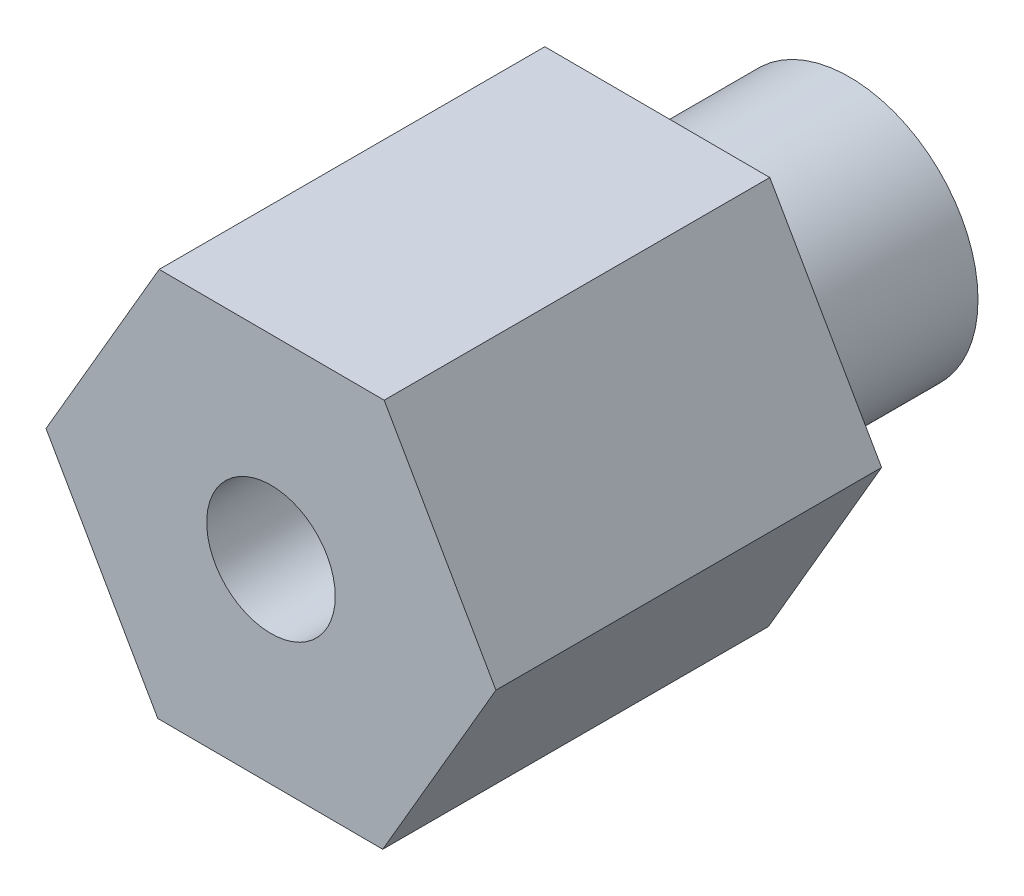
ISO-10303-21;
HEADER;
FILE_DESCRIPTION(('STEP AP214'),'2;1');
FILE_NAME('part.step','',(''),(''),'','','');
FILE_SCHEMA(('AUTOMOTIVE_DESIGN { 1 0 10303 214 1 1 1 1 }'));
ENDSEC;
DATA;
#1=APPLICATION_CONTEXT('core data for automotive mechanical design processes');
#2=APPLICATION_PROTOCOL_DEFINITION('international standard','automotive_design',2000,#1);
#3=PRODUCT_CONTEXT('',#1,'mechanical');
#4=PRODUCT('Part','Part','',(#3));
#5=PRODUCT_RELATED_PRODUCT_CATEGORY('part','',(#4));
#6=PRODUCT_DEFINITION_FORMATION('','',#4);
#7=PRODUCT_DEFINITION_CONTEXT('part definition',#1,'design');
#8=PRODUCT_DEFINITION('design','',#6,#7);
#9=PRODUCT_DEFINITION_SHAPE('','',#8);
#10=(LENGTH_UNIT() NAMED_UNIT(*) SI_UNIT(.MILLI.,.METRE.));
#11=(NAMED_UNIT(*) PLANE_ANGLE_UNIT() SI_UNIT($,.RADIAN.));
#12=(NAMED_UNIT(*) SI_UNIT($,.STERADIAN.) SOLID_ANGLE_UNIT());
#13=UNCERTAINTY_MEASURE_WITH_UNIT(LENGTH_MEASURE(1.E-05),#10,'distance_accuracy_value','');
#14=(GEOMETRIC_REPRESENTATION_CONTEXT(3) GLOBAL_UNCERTAINTY_ASSIGNED_CONTEXT((#13)) GLOBAL_UNIT_ASSIGNED_CONTEXT((#10,
#11,#12)) REPRESENTATION_CONTEXT('',''));
#15=CARTESIAN_POINT('',(0.,0.,0.));
#16=DIRECTION('',(0.,0.,1.));
#17=DIRECTION('',(1.,0.,0.));
#18=AXIS2_PLACEMENT_3D('',#15,#16,#17);
#19=CARTESIAN_POINT('',(0.,0.,3.));
#20=DIRECTION('',(0.,0.,-1.));
#21=DIRECTION('',(-1.,0.,0.));
#22=AXIS2_PLACEMENT_3D('',#19,#20,#21);
#23=CYLINDRICAL_SURFACE('',#22,2.);
#24=CARTESIAN_POINT('',(0.,0.,3.));
#25=DIRECTION('',(0.,0.,1.));
#26=DIRECTION('',(1.,0.,0.));
#27=AXIS2_PLACEMENT_3D('',#24,#25,#26);
#28=CIRCLE('',#27,2.);
#29=CARTESIAN_POINT('',(2.,0.,3.));
#30=VERTEX_POINT('',#29);
#31=EDGE_CURVE('E11',#30,#30,#28,.T.);
#32=ORIENTED_EDGE('',*,*,#31,.F.);
#33=EDGE_LOOP('',(#32));
#34=FACE_BOUND('',#33,.T.);
#35=CARTESIAN_POINT('',(0.,0.,0.));
#36=DIRECTION('',(0.,0.,1.));
#37=DIRECTION('',(1.,0.,0.));
#38=AXIS2_PLACEMENT_3D('',#35,#36,#37);
#39=CIRCLE('',#38,2.);
#40=CARTESIAN_POINT('',(2.,0.,0.));
#41=VERTEX_POINT('',#40);
#42=EDGE_CURVE('E39',#41,#41,#39,.T.);
#43=ORIENTED_EDGE('',*,*,#42,.T.);
#44=EDGE_LOOP('',(#43));
#45=FACE_BOUND('',#44,.T.);
#46=ADVANCED_FACE('F36',(#34,#45),#23,.T.);
#47=CARTESIAN_POINT('',(0.,0.,0.));
#48=DIRECTION('',(0.,0.,1.));
#49=DIRECTION('',(1.,0.,0.));
#50=AXIS2_PLACEMENT_3D('',#47,#48,#49);
#51=PLANE('',#50);
#52=CARTESIAN_POINT('',(0.,0.,0.));
#53=DIRECTION('',(0.,0.,1.));
#54=DIRECTION('',(1.,0.,0.));
#55=AXIS2_PLACEMENT_3D('',#52,#53,#54);
#56=CIRCLE('',#55,1.);
#57=CARTESIAN_POINT('',(1.,0.,0.));
#58=VERTEX_POINT('',#57);
#59=EDGE_CURVE('E125',#58,#58,#56,.T.);
#60=ORIENTED_EDGE('',*,*,#59,.T.);
#61=EDGE_LOOP('',(#60));
#62=FACE_BOUND('',#61,.T.);
#63=ORIENTED_EDGE('',*,*,#42,.F.);
#64=EDGE_LOOP('',(#63));
#65=FACE_BOUND('',#64,.T.);
#66=ADVANCED_FACE('F145',(#62,#65),#51,.F.);
#67=CARTESIAN_POINT('',(1.76087754494395,3.02478268173303,3.));
#68=DIRECTION('',(0.,0.,1.));
#69=DIRECTION('',(1.,0.,0.));
#70=AXIS2_PLACEMENT_3D('',#67,#68,#69);
#71=PLANE('',#70);
#72=DIRECTION('',(-0.496885677381732,0.86781600792616,0.));
#73=VECTOR('',#72,1.);
#74=CARTESIAN_POINT('',(3.49997741578,-0.0125733460085145,3.));
#75=LINE('',#74,#73);
#76=CARTESIAN_POINT('',(3.49997741578,-0.0125733460085145,3.));
#77=VERTEX_POINT('',#76);
#78=CARTESIAN_POINT('',(1.76087754494395,3.02478268173303,3.));
#79=VERTEX_POINT('',#78);
#80=EDGE_CURVE('E121',#77,#79,#75,.T.);
#81=ORIENTED_EDGE('',*,*,#80,.F.);
#82=DIRECTION('',(0.503107869983986,0.864223623352299,0.));
#83=VECTOR('',#82,1.);
#84=CARTESIAN_POINT('',(1.73909987083605,-3.03735602774155,3.));
#85=LINE('',#84,#83);
#86=CARTESIAN_POINT('',(1.73909987083605,-3.03735602774155,3.));
#87=VERTEX_POINT('',#86);
#88=EDGE_CURVE('E81',#87,#77,#85,.T.);
#89=ORIENTED_EDGE('',*,*,#88,.F.);
#90=DIRECTION('',(0.999993547365718,-0.00359238457386166,0.));
#91=VECTOR('',#90,1.);
#92=CARTESIAN_POINT('',(-1.76087754494395,-3.02478268173303,3.));
#93=LINE('',#92,#91);
#94=CARTESIAN_POINT('',(-1.76087754494395,-3.02478268173303,3.));
#95=VERTEX_POINT('',#94);
#96=EDGE_CURVE('E75',#95,#87,#93,.T.);
#97=ORIENTED_EDGE('',*,*,#96,.F.);
#98=DIRECTION('',(0.496885677381732,-0.86781600792616,0.));
#99=VECTOR('',#98,1.);
#100=CARTESIAN_POINT('',(-3.49997741578,0.012573346008514,3.));
#101=LINE('',#100,#99);
#102=CARTESIAN_POINT('',(-3.49997741578,0.012573346008514,3.));
#103=VERTEX_POINT('',#102);
#104=EDGE_CURVE('E111',#103,#95,#101,.T.);
#105=ORIENTED_EDGE('',*,*,#104,.F.);
#106=DIRECTION('',(-0.503107869983986,-0.864223623352299,0.));
#107=VECTOR('',#106,1.);
#108=CARTESIAN_POINT('',(-1.73909987083606,3.03735602774155,3.));
#109=LINE('',#108,#107);
#110=CARTESIAN_POINT('',(-1.73909987083606,3.03735602774155,3.));
#111=VERTEX_POINT('',#110);
#112=EDGE_CURVE('E127',#111,#103,#109,.T.);
#113=ORIENTED_EDGE('',*,*,#112,.F.);
#114=DIRECTION('',(-0.999993547365718,0.00359238457386166,0.));
#115=VECTOR('',#114,1.);
#116=CARTESIAN_POINT('',(1.76087754494395,3.02478268173303,3.));
#117=LINE('',#116,#115);
#118=EDGE_CURVE('E124',#79,#111,#117,.T.);
#119=ORIENTED_EDGE('',*,*,#118,.F.);
#120=EDGE_LOOP('',(#81,#89,#97,#105,#113,#119));
#121=FACE_BOUND('',#120,.T.);
#122=ORIENTED_EDGE('',*,*,#31,.T.);
#123=EDGE_LOOP('',(#122));
#124=FACE_BOUND('',#123,.T.);
#125=ADVANCED_FACE('F147',(#121,#124),#71,.F.);
#126=CARTESIAN_POINT('',(3.49997741578,-0.0125733460085145,9.));
#127=DIRECTION('',(-0.86781600792616,-0.496885677381732,0.));
#128=DIRECTION('',(0.496885677381732,-0.86781600792616,0.));
#129=AXIS2_PLACEMENT_3D('',#126,#127,#128);
#130=PLANE('',#129);
#131=ORIENTED_EDGE('',*,*,#80,.T.);
#132=DIRECTION('',(0.,0.,-1.));
#133=VECTOR('',#132,1.);
#134=CARTESIAN_POINT('',(1.76087754494395,3.02478268173303,9.));
#135=LINE('',#134,#133);
#136=CARTESIAN_POINT('',(1.76087754494395,3.02478268173303,9.));
#137=VERTEX_POINT('',#136);
#138=EDGE_CURVE('E139',#137,#79,#135,.T.);
#139=ORIENTED_EDGE('',*,*,#138,.F.);
#140=DIRECTION('',(-0.496885677381732,0.86781600792616,0.));
#141=VECTOR('',#140,1.);
#142=CARTESIAN_POINT('',(3.49997741578,-0.0125733460085145,9.));
#143=LINE('',#142,#141);
#144=CARTESIAN_POINT('',(3.49997741578,-0.0125733460085145,9.));
#145=VERTEX_POINT('',#144);
#146=EDGE_CURVE('E132',#145,#137,#143,.T.);
#147=ORIENTED_EDGE('',*,*,#146,.F.);
#148=DIRECTION('',(0.,0.,-1.));
#149=VECTOR('',#148,1.);
#150=CARTESIAN_POINT('',(3.49997741578,-0.0125733460085145,9.));
#151=LINE('',#150,#149);
#152=EDGE_CURVE('E117',#145,#77,#151,.T.);
#153=ORIENTED_EDGE('',*,*,#152,.T.);
#154=EDGE_LOOP('',(#131,#139,#147,#153));
#155=FACE_BOUND('',#154,.T.);
#156=ADVANCED_FACE('F153',(#155),#130,.F.);
#157=CARTESIAN_POINT('',(1.76087754494395,3.02478268173303,9.));
#158=DIRECTION('',(-0.00359238457386166,-0.999993547365719,0.));
#159=DIRECTION('',(0.999993547365719,-0.00359238457386166,0.));
#160=AXIS2_PLACEMENT_3D('',#157,#158,#159);
#161=PLANE('',#160);
#162=ORIENTED_EDGE('',*,*,#118,.T.);
#163=DIRECTION('',(0.,0.,-1.));
#164=VECTOR('',#163,1.);
#165=CARTESIAN_POINT('',(-1.73909987083606,3.03735602774155,9.));
#166=LINE('',#165,#164);
#167=CARTESIAN_POINT('',(-1.73909987083606,3.03735602774155,9.));
#168=VERTEX_POINT('',#167);
#169=EDGE_CURVE('E136',#168,#111,#166,.T.);
#170=ORIENTED_EDGE('',*,*,#169,.F.);
#171=DIRECTION('',(-0.999993547365718,0.00359238457386166,0.));
#172=VECTOR('',#171,1.);
#173=CARTESIAN_POINT('',(1.76087754494395,3.02478268173303,9.));
#174=LINE('',#173,#172);
#175=EDGE_CURVE('E90',#137,#168,#174,.T.);
#176=ORIENTED_EDGE('',*,*,#175,.F.);
#177=ORIENTED_EDGE('',*,*,#138,.T.);
#178=EDGE_LOOP('',(#162,#170,#176,#177));
#179=FACE_BOUND('',#178,.T.);
#180=ADVANCED_FACE('F161',(#179),#161,.F.);
#181=CARTESIAN_POINT('',(-1.73909987083606,3.03735602774155,9.));
#182=DIRECTION('',(0.864223623352299,-0.503107869983986,0.));
#183=DIRECTION('',(0.503107869983986,0.864223623352299,0.));
#184=AXIS2_PLACEMENT_3D('',#181,#182,#183);
#185=PLANE('',#184);
#186=ORIENTED_EDGE('',*,*,#112,.T.);
#187=DIRECTION('',(0.,0.,-1.));
#188=VECTOR('',#187,1.);
#189=CARTESIAN_POINT('',(-3.49997741578,0.012573346008514,9.));
#190=LINE('',#189,#188);
#191=CARTESIAN_POINT('',(-3.49997741578,0.012573346008514,9.));
#192=VERTEX_POINT('',#191);
#193=EDGE_CURVE('E112',#192,#103,#190,.T.);
#194=ORIENTED_EDGE('',*,*,#193,.F.);
#195=DIRECTION('',(-0.503107869983986,-0.864223623352299,0.));
#196=VECTOR('',#195,1.);
#197=CARTESIAN_POINT('',(-1.73909987083606,3.03735602774155,9.));
#198=LINE('',#197,#196);
#199=EDGE_CURVE('E103',#168,#192,#198,.T.);
#200=ORIENTED_EDGE('',*,*,#199,.F.);
#201=ORIENTED_EDGE('',*,*,#169,.T.);
#202=EDGE_LOOP('',(#186,#194,#200,#201));
#203=FACE_BOUND('',#202,.T.);
#204=ADVANCED_FACE('F165',(#203),#185,.F.);
#205=CARTESIAN_POINT('',(-3.49997741578,0.012573346008514,9.));
#206=DIRECTION('',(0.86781600792616,0.496885677381732,0.));
#207=DIRECTION('',(-0.496885677381732,0.86781600792616,0.));
#208=AXIS2_PLACEMENT_3D('',#205,#206,#207);
#209=PLANE('',#208);
#210=ORIENTED_EDGE('',*,*,#104,.T.);
#211=DIRECTION('',(0.,0.,-1.));
#212=VECTOR('',#211,1.);
#213=CARTESIAN_POINT('',(-1.76087754494395,-3.02478268173303,9.));
#214=LINE('',#213,#212);
#215=CARTESIAN_POINT('',(-1.76087754494395,-3.02478268173303,9.));
#216=VERTEX_POINT('',#215);
#217=EDGE_CURVE('E108',#216,#95,#214,.T.);
#218=ORIENTED_EDGE('',*,*,#217,.F.);
#219=DIRECTION('',(0.496885677381732,-0.86781600792616,0.));
#220=VECTOR('',#219,1.);
#221=CARTESIAN_POINT('',(-3.49997741578,0.012573346008514,9.));
#222=LINE('',#221,#220);
#223=EDGE_CURVE('E97',#192,#216,#222,.T.);
#224=ORIENTED_EDGE('',*,*,#223,.F.);
#225=ORIENTED_EDGE('',*,*,#193,.T.);
#226=EDGE_LOOP('',(#210,#218,#224,#225));
#227=FACE_BOUND('',#226,.T.);
#228=ADVANCED_FACE('F109',(#227),#209,.F.);
#229=CARTESIAN_POINT('',(-1.76087754494395,-3.02478268173303,9.));
#230=DIRECTION('',(0.00359238457386166,0.999993547365718,0.));
#231=DIRECTION('',(-0.999993547365719,0.00359238457386166,0.));
#232=AXIS2_PLACEMENT_3D('',#229,#230,#231);
#233=PLANE('',#232);
#234=ORIENTED_EDGE('',*,*,#96,.T.);
#235=DIRECTION('',(0.,0.,-1.));
#236=VECTOR('',#235,1.);
#237=CARTESIAN_POINT('',(1.73909987083605,-3.03735602774155,9.));
#238=LINE('',#237,#236);
#239=CARTESIAN_POINT('',(1.73909987083605,-3.03735602774155,9.));
#240=VERTEX_POINT('',#239);
#241=EDGE_CURVE('E113',#240,#87,#238,.T.);
#242=ORIENTED_EDGE('',*,*,#241,.F.);
#243=DIRECTION('',(0.999993547365718,-0.00359238457386166,0.));
#244=VECTOR('',#243,1.);
#245=CARTESIAN_POINT('',(-1.76087754494395,-3.02478268173303,9.));
#246=LINE('',#245,#244);
#247=EDGE_CURVE('E101',#216,#240,#246,.T.);
#248=ORIENTED_EDGE('',*,*,#247,.F.);
#249=ORIENTED_EDGE('',*,*,#217,.T.);
#250=EDGE_LOOP('',(#234,#242,#248,#249));
#251=FACE_BOUND('',#250,.T.);
#252=ADVANCED_FACE('F115',(#251),#233,.F.);
#253=CARTESIAN_POINT('',(1.73909987083605,-3.03735602774155,9.));
#254=DIRECTION('',(-0.864223623352299,0.503107869983986,0.));
#255=DIRECTION('',(-0.503107869983986,-0.864223623352299,0.));
#256=AXIS2_PLACEMENT_3D('',#253,#254,#255);
#257=PLANE('',#256);
#258=ORIENTED_EDGE('',*,*,#88,.T.);
#259=ORIENTED_EDGE('',*,*,#152,.F.);
#260=DIRECTION('',(0.503107869983986,0.864223623352299,0.));
#261=VECTOR('',#260,1.);
#262=CARTESIAN_POINT('',(1.73909987083605,-3.03735602774155,9.));
#263=LINE('',#262,#261);
#264=EDGE_CURVE('E52',#240,#145,#263,.T.);
#265=ORIENTED_EDGE('',*,*,#264,.F.);
#266=ORIENTED_EDGE('',*,*,#241,.T.);
#267=EDGE_LOOP('',(#258,#259,#265,#266));
#268=FACE_BOUND('',#267,.T.);
#269=ADVANCED_FACE('F173',(#268),#257,.F.);
#270=CARTESIAN_POINT('',(1.76087754494395,3.02478268173303,9.));
#271=DIRECTION('',(0.,0.,1.));
#272=DIRECTION('',(1.,0.,0.));
#273=AXIS2_PLACEMENT_3D('',#270,#271,#272);
#274=PLANE('',#273);
#275=CARTESIAN_POINT('',(0.,0.,9.));
#276=DIRECTION('',(0.,0.,1.));
#277=DIRECTION('',(1.,0.,0.));
#278=AXIS2_PLACEMENT_3D('',#275,#276,#277);
#279=CIRCLE('',#278,1.);
#280=CARTESIAN_POINT('',(1.,0.,9.));
#281=VERTEX_POINT('',#280);
#282=EDGE_CURVE('E187',#281,#281,#279,.T.);
#283=ORIENTED_EDGE('',*,*,#282,.F.);
#284=EDGE_LOOP('',(#283));
#285=FACE_BOUND('',#284,.T.);
#286=ORIENTED_EDGE('',*,*,#146,.T.);
#287=ORIENTED_EDGE('',*,*,#175,.T.);
#288=ORIENTED_EDGE('',*,*,#199,.T.);
#289=ORIENTED_EDGE('',*,*,#223,.T.);
#290=ORIENTED_EDGE('',*,*,#247,.T.);
#291=ORIENTED_EDGE('',*,*,#264,.T.);
#292=EDGE_LOOP('',(#286,#287,#288,#289,#290,#291));
#293=FACE_BOUND('',#292,.T.);
#294=ADVANCED_FACE('F99',(#285,#293),#274,.T.);
#295=CARTESIAN_POINT('',(0.,0.,-1.));
#296=DIRECTION('',(0.,0.,1.));
#297=DIRECTION('',(1.,0.,0.));
#298=AXIS2_PLACEMENT_3D('',#295,#296,#297);
#299=CYLINDRICAL_SURFACE('',#298,1.);
#300=ORIENTED_EDGE('',*,*,#282,.T.);
#301=EDGE_LOOP('',(#300));
#302=FACE_BOUND('',#301,.T.);
#303=ORIENTED_EDGE('',*,*,#59,.F.);
#304=EDGE_LOOP('',(#303));
#305=FACE_BOUND('',#304,.T.);
#306=ADVANCED_FACE('F178',(#302,#305),#299,.F.);
#307=CLOSED_SHELL('',(#46,#66,#125,#156,#180,#204,#228,#252,#269,#294,#306));
#308=MANIFOLD_SOLID_BREP('B2',#307);
#309=ADVANCED_BREP_SHAPE_REPRESENTATION('',(#18,#308),#14);
#310=SHAPE_DEFINITION_REPRESENTATION(#9,#309);
ENDSEC;
END-ISO-10303-21;
